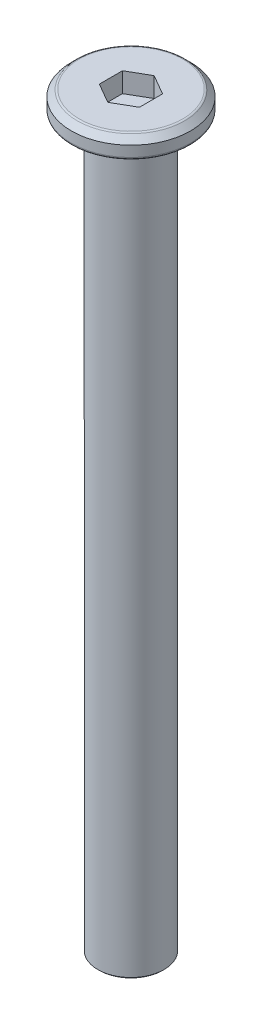
ISO-10303-21;
HEADER;
FILE_DESCRIPTION(('STEP AP214'),'2;1');
FILE_NAME('part.step','',(''),(''),'','','');
FILE_SCHEMA(('AUTOMOTIVE_DESIGN { 1 0 10303 214 1 1 1 1 }'));
ENDSEC;
DATA;
#1=APPLICATION_CONTEXT('core data for automotive mechanical design processes');
#2=APPLICATION_PROTOCOL_DEFINITION('international standard','automotive_design',2000,#1);
#3=PRODUCT_CONTEXT('',#1,'mechanical');
#4=PRODUCT('Part','Part','',(#3));
#5=PRODUCT_RELATED_PRODUCT_CATEGORY('part','',(#4));
#6=PRODUCT_DEFINITION_FORMATION('','',#4);
#7=PRODUCT_DEFINITION_CONTEXT('part definition',#1,'design');
#8=PRODUCT_DEFINITION('design','',#6,#7);
#9=PRODUCT_DEFINITION_SHAPE('','',#8);
#10=(LENGTH_UNIT() NAMED_UNIT(*) SI_UNIT(.MILLI.,.METRE.));
#11=(NAMED_UNIT(*) PLANE_ANGLE_UNIT() SI_UNIT($,.RADIAN.));
#12=(NAMED_UNIT(*) SI_UNIT($,.STERADIAN.) SOLID_ANGLE_UNIT());
#13=UNCERTAINTY_MEASURE_WITH_UNIT(LENGTH_MEASURE(1.E-05),#10,'distance_accuracy_value','');
#14=(GEOMETRIC_REPRESENTATION_CONTEXT(3) GLOBAL_UNCERTAINTY_ASSIGNED_CONTEXT((#13)) GLOBAL_UNIT_ASSIGNED_CONTEXT((#10,
#11,#12)) REPRESENTATION_CONTEXT('',''));
#15=CARTESIAN_POINT('',(0.,0.,0.));
#16=DIRECTION('',(0.,0.,1.));
#17=DIRECTION('',(1.,0.,0.));
#18=AXIS2_PLACEMENT_3D('',#15,#16,#17);
#19=CARTESIAN_POINT('',(0.,1.5,0.));
#20=DIRECTION('',(0.,-1.,0.));
#21=DIRECTION('',(0.,0.,-1.));
#22=AXIS2_PLACEMENT_3D('',#19,#20,#21);
#23=CYLINDRICAL_SURFACE('',#22,4.5);
#24=CARTESIAN_POINT('',(0.,0.2,0.));
#25=DIRECTION('',(0.,1.,0.));
#26=DIRECTION('',(0.,0.,1.));
#27=AXIS2_PLACEMENT_3D('',#24,#25,#26);
#28=CIRCLE('',#27,4.5);
#29=CARTESIAN_POINT('',(0.,0.2,4.5));
#30=VERTEX_POINT('',#29);
#31=EDGE_CURVE('E131',#30,#30,#28,.T.);
#32=ORIENTED_EDGE('',*,*,#31,.T.);
#33=EDGE_LOOP('',(#32));
#34=FACE_BOUND('',#33,.T.);
#35=CARTESIAN_POINT('',(0.,0.999999999999997,0.));
#36=DIRECTION('',(0.,1.,0.));
#37=DIRECTION('',(0.,0.,1.));
#38=AXIS2_PLACEMENT_3D('',#35,#36,#37);
#39=CIRCLE('',#38,4.5);
#40=CARTESIAN_POINT('',(0.,0.999999999999997,4.5));
#41=VERTEX_POINT('',#40);
#42=EDGE_CURVE('E117',#41,#41,#39,.F.);
#43=ORIENTED_EDGE('',*,*,#42,.T.);
#44=EDGE_LOOP('',(#43));
#45=FACE_BOUND('',#44,.T.);
#46=ADVANCED_FACE('F16',(#34,#45),#23,.T.);
#47=CARTESIAN_POINT('',(0.,1.5,0.));
#48=DIRECTION('',(0.,1.,0.));
#49=DIRECTION('',(0.,0.,1.));
#50=AXIS2_PLACEMENT_3D('',#47,#48,#49);
#51=PLANE('',#50);
#52=CARTESIAN_POINT('',(0.,1.5,0.));
#53=DIRECTION('',(0.,1.,0.));
#54=DIRECTION('',(0.,0.,1.));
#55=AXIS2_PLACEMENT_3D('',#52,#53,#54);
#56=CIRCLE('',#55,3.91715728752538);
#57=CARTESIAN_POINT('',(0.,1.5,3.91715728752538));
#58=VERTEX_POINT('',#57);
#59=EDGE_CURVE('E125',#58,#58,#56,.T.);
#60=ORIENTED_EDGE('',*,*,#59,.T.);
#61=EDGE_LOOP('',(#60));
#62=FACE_BOUND('',#61,.T.);
#63=DIRECTION('',(-0.866025403784438,0.,-0.5));
#64=VECTOR('',#63,1.);
#65=CARTESIAN_POINT('',(1.51554445662277,1.5,-0.875));
#66=LINE('',#65,#64);
#67=CARTESIAN_POINT('',(1.51554445662277,1.5,-0.875));
#68=VERTEX_POINT('',#67);
#69=CARTESIAN_POINT('',(0.,1.5,-1.75));
#70=VERTEX_POINT('',#69);
#71=EDGE_CURVE('E32',#68,#70,#66,.T.);
#72=ORIENTED_EDGE('',*,*,#71,.F.);
#73=DIRECTION('',(0.,0.,-1.));
#74=VECTOR('',#73,1.);
#75=CARTESIAN_POINT('',(1.51554445662277,1.5,0.875000000000001));
#76=LINE('',#75,#74);
#77=CARTESIAN_POINT('',(1.51554445662277,1.5,0.875000000000001));
#78=VERTEX_POINT('',#77);
#79=EDGE_CURVE('E113',#78,#68,#76,.T.);
#80=ORIENTED_EDGE('',*,*,#79,.F.);
#81=DIRECTION('',(0.866025403784439,0.,-0.5));
#82=VECTOR('',#81,1.);
#83=CARTESIAN_POINT('',(0.,1.5,1.75));
#84=LINE('',#83,#82);
#85=CARTESIAN_POINT('',(0.,1.5,1.75));
#86=VERTEX_POINT('',#85);
#87=EDGE_CURVE('E111',#86,#78,#84,.T.);
#88=ORIENTED_EDGE('',*,*,#87,.F.);
#89=DIRECTION('',(0.866025403784438,0.,0.5));
#90=VECTOR('',#89,1.);
#91=CARTESIAN_POINT('',(-1.51554445662277,1.5,0.874999999999999));
#92=LINE('',#91,#90);
#93=CARTESIAN_POINT('',(-1.51554445662277,1.5,0.874999999999999));
#94=VERTEX_POINT('',#93);
#95=EDGE_CURVE('E79',#94,#86,#92,.T.);
#96=ORIENTED_EDGE('',*,*,#95,.F.);
#97=DIRECTION('',(0.,0.,1.));
#98=VECTOR('',#97,1.);
#99=CARTESIAN_POINT('',(-1.51554445662277,1.5,-0.875));
#100=LINE('',#99,#98);
#101=CARTESIAN_POINT('',(-1.51554445662277,1.5,-0.875));
#102=VERTEX_POINT('',#101);
#103=EDGE_CURVE('E107',#102,#94,#100,.T.);
#104=ORIENTED_EDGE('',*,*,#103,.F.);
#105=DIRECTION('',(-0.866025403784439,0.,0.5));
#106=VECTOR('',#105,1.);
#107=CARTESIAN_POINT('',(0.,1.5,-1.75));
#108=LINE('',#107,#106);
#109=EDGE_CURVE('E104',#70,#102,#108,.T.);
#110=ORIENTED_EDGE('',*,*,#109,.F.);
#111=EDGE_LOOP('',(#72,#80,#88,#96,#104,#110));
#112=FACE_BOUND('',#111,.T.);
#113=ADVANCED_FACE('F158',(#62,#112),#51,.T.);
#114=CARTESIAN_POINT('',(0.,0.,0.));
#115=DIRECTION('',(0.,1.,0.));
#116=DIRECTION('',(0.,0.,1.));
#117=AXIS2_PLACEMENT_3D('',#114,#115,#116);
#118=PLANE('',#117);
#119=CARTESIAN_POINT('',(0.,0.,0.));
#120=DIRECTION('',(0.,1.,0.));
#121=DIRECTION('',(0.,0.,1.));
#122=AXIS2_PLACEMENT_3D('',#119,#120,#121);
#123=CIRCLE('',#122,2.75);
#124=CARTESIAN_POINT('',(0.,0.,2.75));
#125=VERTEX_POINT('',#124);
#126=EDGE_CURVE('E140',#125,#125,#123,.T.);
#127=ORIENTED_EDGE('',*,*,#126,.T.);
#128=EDGE_LOOP('',(#127));
#129=FACE_BOUND('',#128,.T.);
#130=CARTESIAN_POINT('',(0.,0.,0.));
#131=DIRECTION('',(0.,1.,0.));
#132=DIRECTION('',(0.,0.,1.));
#133=AXIS2_PLACEMENT_3D('',#130,#131,#132);
#134=CIRCLE('',#133,4.3);
#135=CARTESIAN_POINT('',(0.,0.,4.3));
#136=VERTEX_POINT('',#135);
#137=EDGE_CURVE('E134',#136,#136,#134,.F.);
#138=ORIENTED_EDGE('',*,*,#137,.T.);
#139=EDGE_LOOP('',(#138));
#140=FACE_BOUND('',#139,.T.);
#141=ADVANCED_FACE('F164',(#129,#140),#118,.F.);
#142=CARTESIAN_POINT('',(0.,1.5,0.));
#143=DIRECTION('',(0.,-1.,0.));
#144=DIRECTION('',(0.,0.,-1.));
#145=AXIS2_PLACEMENT_3D('',#142,#143,#144);
#146=CONICAL_SURFACE('',#145,4.,0.785398163397447);
#147=CARTESIAN_POINT('',(0.,1.44142135623731,0.));
#148=DIRECTION('',(0.,1.,0.));
#149=DIRECTION('',(0.,0.,1.));
#150=AXIS2_PLACEMENT_3D('',#147,#148,#149);
#151=CIRCLE('',#150,4.05857864376269);
#152=CARTESIAN_POINT('',(0.,1.44142135623731,4.05857864376269));
#153=VERTEX_POINT('',#152);
#154=EDGE_CURVE('E128',#153,#153,#151,.F.);
#155=ORIENTED_EDGE('',*,*,#154,.T.);
#156=EDGE_LOOP('',(#155));
#157=FACE_BOUND('',#156,.T.);
#158=ORIENTED_EDGE('',*,*,#42,.F.);
#159=EDGE_LOOP('',(#158));
#160=FACE_BOUND('',#159,.T.);
#161=ADVANCED_FACE('F170',(#157,#160),#146,.T.);
#162=CARTESIAN_POINT('',(1.51554445662277,0.,-0.875));
#163=DIRECTION('',(0.5,0.,-0.866025403784439));
#164=DIRECTION('',(-0.866025403784439,0.,-0.5));
#165=AXIS2_PLACEMENT_3D('',#162,#163,#164);
#166=PLANE('',#165);
#167=ORIENTED_EDGE('',*,*,#71,.T.);
#168=DIRECTION('',(0.,1.,0.));
#169=VECTOR('',#168,1.);
#170=CARTESIAN_POINT('',(0.,0.,-1.75));
#171=LINE('',#170,#169);
#172=CARTESIAN_POINT('',(0.,0.,-1.75));
#173=VERTEX_POINT('',#172);
#174=EDGE_CURVE('E63',#173,#70,#171,.T.);
#175=ORIENTED_EDGE('',*,*,#174,.F.);
#176=DIRECTION('',(-0.866025403784438,0.,-0.5));
#177=VECTOR('',#176,1.);
#178=CARTESIAN_POINT('',(1.51554445662277,0.,-0.875));
#179=LINE('',#178,#177);
#180=CARTESIAN_POINT('',(1.51554445662277,0.,-0.875));
#181=VERTEX_POINT('',#180);
#182=EDGE_CURVE('E115',#181,#173,#179,.T.);
#183=ORIENTED_EDGE('',*,*,#182,.F.);
#184=DIRECTION('',(0.,1.,0.));
#185=VECTOR('',#184,1.);
#186=CARTESIAN_POINT('',(1.51554445662277,0.,-0.875));
#187=LINE('',#186,#185);
#188=EDGE_CURVE('E40',#181,#68,#187,.T.);
#189=ORIENTED_EDGE('',*,*,#188,.T.);
#190=EDGE_LOOP('',(#167,#175,#183,#189));
#191=FACE_BOUND('',#190,.T.);
#192=ADVANCED_FACE('F173',(#191),#166,.F.);
#193=CARTESIAN_POINT('',(1.51554445662277,0.,0.875000000000001));
#194=DIRECTION('',(1.,0.,0.));
#195=DIRECTION('',(0.,0.,-1.));
#196=AXIS2_PLACEMENT_3D('',#193,#194,#195);
#197=PLANE('',#196);
#198=ORIENTED_EDGE('',*,*,#79,.T.);
#199=ORIENTED_EDGE('',*,*,#188,.F.);
#200=DIRECTION('',(0.,0.,-1.));
#201=VECTOR('',#200,1.);
#202=CARTESIAN_POINT('',(1.51554445662277,0.,0.875000000000001));
#203=LINE('',#202,#201);
#204=CARTESIAN_POINT('',(1.51554445662277,0.,0.875000000000001));
#205=VERTEX_POINT('',#204);
#206=EDGE_CURVE('E91',#205,#181,#203,.T.);
#207=ORIENTED_EDGE('',*,*,#206,.F.);
#208=DIRECTION('',(0.,1.,0.));
#209=VECTOR('',#208,1.);
#210=CARTESIAN_POINT('',(1.51554445662277,0.,0.875000000000001));
#211=LINE('',#210,#209);
#212=EDGE_CURVE('E83',#205,#78,#211,.T.);
#213=ORIENTED_EDGE('',*,*,#212,.T.);
#214=EDGE_LOOP('',(#198,#199,#207,#213));
#215=FACE_BOUND('',#214,.T.);
#216=ADVANCED_FACE('F207',(#215),#197,.F.);
#217=CARTESIAN_POINT('',(0.,0.,1.75));
#218=DIRECTION('',(0.5,0.,0.866025403784439));
#219=DIRECTION('',(0.866025403784439,0.,-0.5));
#220=AXIS2_PLACEMENT_3D('',#217,#218,#219);
#221=PLANE('',#220);
#222=ORIENTED_EDGE('',*,*,#87,.T.);
#223=ORIENTED_EDGE('',*,*,#212,.F.);
#224=DIRECTION('',(0.866025403784439,0.,-0.5));
#225=VECTOR('',#224,1.);
#226=CARTESIAN_POINT('',(0.,0.,1.75));
#227=LINE('',#226,#225);
#228=CARTESIAN_POINT('',(0.,0.,1.75));
#229=VERTEX_POINT('',#228);
#230=EDGE_CURVE('E87',#229,#205,#227,.T.);
#231=ORIENTED_EDGE('',*,*,#230,.F.);
#232=DIRECTION('',(0.,1.,0.));
#233=VECTOR('',#232,1.);
#234=CARTESIAN_POINT('',(0.,0.,1.75));
#235=LINE('',#234,#233);
#236=EDGE_CURVE('E72',#229,#86,#235,.T.);
#237=ORIENTED_EDGE('',*,*,#236,.T.);
#238=EDGE_LOOP('',(#222,#223,#231,#237));
#239=FACE_BOUND('',#238,.T.);
#240=ADVANCED_FACE('F88',(#239),#221,.F.);
#241=CARTESIAN_POINT('',(-1.51554445662277,0.,0.874999999999999));
#242=DIRECTION('',(-0.5,0.,0.866025403784438));
#243=DIRECTION('',(0.866025403784439,0.,0.5));
#244=AXIS2_PLACEMENT_3D('',#241,#242,#243);
#245=PLANE('',#244);
#246=ORIENTED_EDGE('',*,*,#95,.T.);
#247=ORIENTED_EDGE('',*,*,#236,.F.);
#248=DIRECTION('',(0.866025403784438,0.,0.5));
#249=VECTOR('',#248,1.);
#250=CARTESIAN_POINT('',(-1.51554445662277,0.,0.874999999999999));
#251=LINE('',#250,#249);
#252=CARTESIAN_POINT('',(-1.51554445662277,0.,0.874999999999999));
#253=VERTEX_POINT('',#252);
#254=EDGE_CURVE('E76',#253,#229,#251,.T.);
#255=ORIENTED_EDGE('',*,*,#254,.F.);
#256=DIRECTION('',(0.,1.,0.));
#257=VECTOR('',#256,1.);
#258=CARTESIAN_POINT('',(-1.51554445662277,0.,0.874999999999999));
#259=LINE('',#258,#257);
#260=EDGE_CURVE('E84',#253,#94,#259,.T.);
#261=ORIENTED_EDGE('',*,*,#260,.T.);
#262=EDGE_LOOP('',(#246,#247,#255,#261));
#263=FACE_BOUND('',#262,.T.);
#264=ADVANCED_FACE('F74',(#263),#245,.F.);
#265=CARTESIAN_POINT('',(-1.51554445662277,0.,-0.875));
#266=DIRECTION('',(-1.,0.,0.));
#267=DIRECTION('',(0.,0.,1.));
#268=AXIS2_PLACEMENT_3D('',#265,#266,#267);
#269=PLANE('',#268);
#270=ORIENTED_EDGE('',*,*,#103,.T.);
#271=ORIENTED_EDGE('',*,*,#260,.F.);
#272=DIRECTION('',(0.,0.,1.));
#273=VECTOR('',#272,1.);
#274=CARTESIAN_POINT('',(-1.51554445662277,0.,-0.875));
#275=LINE('',#274,#273);
#276=CARTESIAN_POINT('',(-1.51554445662277,0.,-0.875000000000001));
#277=VERTEX_POINT('',#276);
#278=EDGE_CURVE('E96',#277,#253,#275,.T.);
#279=ORIENTED_EDGE('',*,*,#278,.F.);
#280=DIRECTION('',(0.,1.,0.));
#281=VECTOR('',#280,1.);
#282=CARTESIAN_POINT('',(-1.51554445662277,0.,-0.875));
#283=LINE('',#282,#281);
#284=EDGE_CURVE('E120',#277,#102,#283,.T.);
#285=ORIENTED_EDGE('',*,*,#284,.T.);
#286=EDGE_LOOP('',(#270,#271,#279,#285));
#287=FACE_BOUND('',#286,.T.);
#288=ADVANCED_FACE('F214',(#287),#269,.F.);
#289=CARTESIAN_POINT('',(0.,0.,-1.75));
#290=DIRECTION('',(-0.5,0.,-0.866025403784439));
#291=DIRECTION('',(-0.866025403784439,0.,0.5));
#292=AXIS2_PLACEMENT_3D('',#289,#290,#291);
#293=PLANE('',#292);
#294=ORIENTED_EDGE('',*,*,#109,.T.);
#295=ORIENTED_EDGE('',*,*,#284,.F.);
#296=DIRECTION('',(-0.866025403784439,0.,0.5));
#297=VECTOR('',#296,1.);
#298=CARTESIAN_POINT('',(0.,0.,-1.75));
#299=LINE('',#298,#297);
#300=EDGE_CURVE('E98',#173,#277,#299,.T.);
#301=ORIENTED_EDGE('',*,*,#300,.F.);
#302=ORIENTED_EDGE('',*,*,#174,.T.);
#303=EDGE_LOOP('',(#294,#295,#301,#302));
#304=FACE_BOUND('',#303,.T.);
#305=ADVANCED_FACE('F204',(#304),#293,.F.);
#306=CARTESIAN_POINT('',(0.,0.,0.));
#307=DIRECTION('',(0.,-1.,0.));
#308=DIRECTION('',(0.,0.,-1.));
#309=AXIS2_PLACEMENT_3D('',#306,#307,#308);
#310=PLANE('',#309);
#311=ORIENTED_EDGE('',*,*,#206,.T.);
#312=ORIENTED_EDGE('',*,*,#182,.T.);
#313=ORIENTED_EDGE('',*,*,#300,.T.);
#314=ORIENTED_EDGE('',*,*,#278,.T.);
#315=ORIENTED_EDGE('',*,*,#254,.T.);
#316=ORIENTED_EDGE('',*,*,#230,.T.);
#317=EDGE_LOOP('',(#311,#312,#313,#314,#315,#316));
#318=FACE_BOUND('',#317,.T.);
#319=ADVANCED_FACE('F93',(#318),#310,.F.);
#320=CARTESIAN_POINT('',(0.,-55.,0.));
#321=DIRECTION('',(0.,1.,0.));
#322=DIRECTION('',(0.,0.,1.));
#323=AXIS2_PLACEMENT_3D('',#320,#321,#322);
#324=CYLINDRICAL_SURFACE('',#323,2.5);
#325=CARTESIAN_POINT('',(0.,-54.9,0.));
#326=DIRECTION('',(0.,-1.,0.));
#327=DIRECTION('',(0.,0.,-1.));
#328=AXIS2_PLACEMENT_3D('',#325,#326,#327);
#329=CIRCLE('',#328,2.5);
#330=CARTESIAN_POINT('',(0.,-54.9,-2.5));
#331=VERTEX_POINT('',#330);
#332=EDGE_CURVE('E10',#331,#331,#329,.F.);
#333=ORIENTED_EDGE('',*,*,#332,.T.);
#334=EDGE_LOOP('',(#333));
#335=FACE_BOUND('',#334,.T.);
#336=CARTESIAN_POINT('',(0.,-0.25,0.));
#337=DIRECTION('',(0.,1.,0.));
#338=DIRECTION('',(0.,0.,1.));
#339=AXIS2_PLACEMENT_3D('',#336,#337,#338);
#340=CIRCLE('',#339,2.5);
#341=CARTESIAN_POINT('',(0.,-0.25,2.5));
#342=VERTEX_POINT('',#341);
#343=EDGE_CURVE('E137',#342,#342,#340,.F.);
#344=ORIENTED_EDGE('',*,*,#343,.T.);
#345=EDGE_LOOP('',(#344));
#346=FACE_BOUND('',#345,.T.);
#347=ADVANCED_FACE('F195',(#335,#346),#324,.T.);
#348=CARTESIAN_POINT('',(0.,-55.,0.));
#349=DIRECTION('',(0.,-1.,0.));
#350=DIRECTION('',(0.,0.,-1.));
#351=AXIS2_PLACEMENT_3D('',#348,#349,#350);
#352=PLANE('',#351);
#353=CARTESIAN_POINT('',(0.,-55.,0.));
#354=DIRECTION('',(0.,-1.,0.));
#355=DIRECTION('',(0.,0.,-1.));
#356=AXIS2_PLACEMENT_3D('',#353,#354,#355);
#357=CIRCLE('',#356,2.4);
#358=CARTESIAN_POINT('',(0.,-55.,-2.4));
#359=VERTEX_POINT('',#358);
#360=EDGE_CURVE('E25',#359,#359,#357,.T.);
#361=ORIENTED_EDGE('',*,*,#360,.T.);
#362=EDGE_LOOP('',(#361));
#363=FACE_BOUND('',#362,.T.);
#364=ADVANCED_FACE('F145',(#363),#352,.T.);
#365=CARTESIAN_POINT('',(0.,1.3,0.));
#366=DIRECTION('',(0.,1.,0.));
#367=DIRECTION('',(0.,0.,1.));
#368=AXIS2_PLACEMENT_3D('',#365,#366,#367);
#369=TOROIDAL_SURFACE('',#368,3.91715728752538,0.2);
#370=ORIENTED_EDGE('',*,*,#154,.F.);
#371=EDGE_LOOP('',(#370));
#372=FACE_BOUND('',#371,.T.);
#373=ORIENTED_EDGE('',*,*,#59,.F.);
#374=EDGE_LOOP('',(#373));
#375=FACE_BOUND('',#374,.T.);
#376=ADVANCED_FACE('F175',(#372,#375),#369,.T.);
#377=CARTESIAN_POINT('',(0.,0.2,0.));
#378=DIRECTION('',(0.,1.,0.));
#379=DIRECTION('',(0.,0.,1.));
#380=AXIS2_PLACEMENT_3D('',#377,#378,#379);
#381=TOROIDAL_SURFACE('',#380,4.3,0.2);
#382=ORIENTED_EDGE('',*,*,#137,.F.);
#383=EDGE_LOOP('',(#382));
#384=FACE_BOUND('',#383,.T.);
#385=ORIENTED_EDGE('',*,*,#31,.F.);
#386=EDGE_LOOP('',(#385));
#387=FACE_BOUND('',#386,.T.);
#388=ADVANCED_FACE('F154',(#384,#387),#381,.T.);
#389=CARTESIAN_POINT('',(0.,-0.25,0.));
#390=DIRECTION('',(0.,1.,0.));
#391=DIRECTION('',(0.,0.,1.));
#392=AXIS2_PLACEMENT_3D('',#389,#390,#391);
#393=TOROIDAL_SURFACE('',#392,2.75,0.25);
#394=ORIENTED_EDGE('',*,*,#126,.F.);
#395=EDGE_LOOP('',(#394));
#396=FACE_BOUND('',#395,.T.);
#397=ORIENTED_EDGE('',*,*,#343,.F.);
#398=EDGE_LOOP('',(#397));
#399=FACE_BOUND('',#398,.T.);
#400=ADVANCED_FACE('F148',(#396,#399),#393,.F.);
#401=CARTESIAN_POINT('',(0.,-55.,0.));
#402=DIRECTION('',(0.,1.,0.));
#403=DIRECTION('',(0.,0.,1.));
#404=AXIS2_PLACEMENT_3D('',#401,#402,#403);
#405=CONICAL_SURFACE('',#404,2.4,0.785398163397472);
#406=ORIENTED_EDGE('',*,*,#332,.F.);
#407=EDGE_LOOP('',(#406));
#408=FACE_BOUND('',#407,.T.);
#409=ORIENTED_EDGE('',*,*,#360,.F.);
#410=EDGE_LOOP('',(#409));
#411=FACE_BOUND('',#410,.T.);
#412=ADVANCED_FACE('F19',(#408,#411),#405,.T.);
#413=CLOSED_SHELL('',(#46,#113,#141,#161,#192,#216,#240,#264,#288,#305,#319,#347,#364,#376,#388,
#400,#412));
#414=MANIFOLD_SOLID_BREP('B1',#413);
#415=ADVANCED_BREP_SHAPE_REPRESENTATION('',(#18,#414),#14);
#416=SHAPE_DEFINITION_REPRESENTATION(#9,#415);
ENDSEC;
END-ISO-10303-21;
